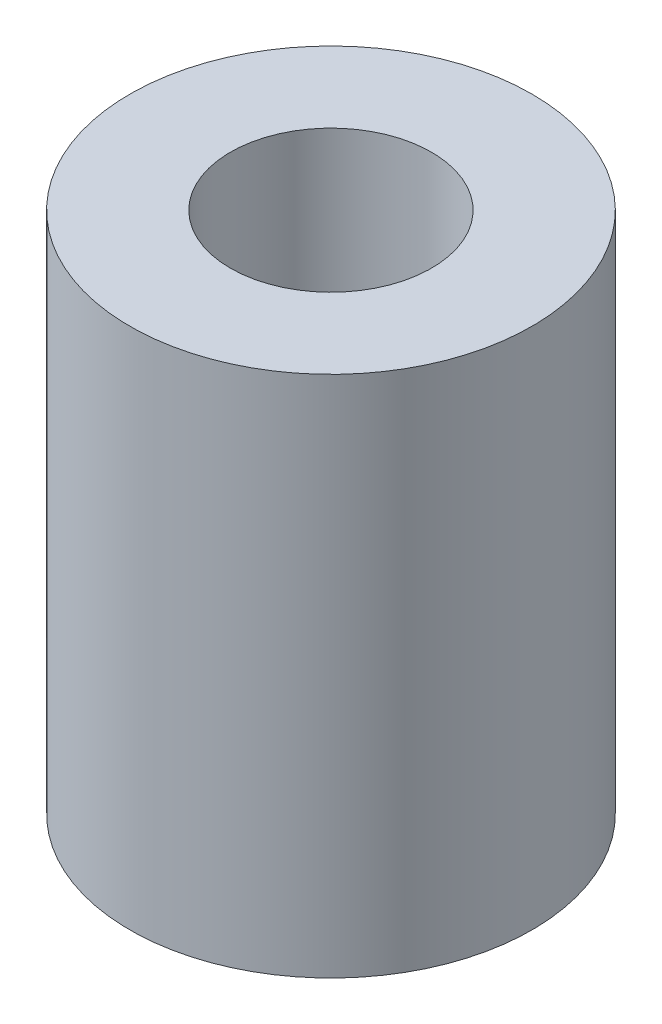
ISO-10303-21;
HEADER;
FILE_DESCRIPTION(('STEP AP214'),'2;1');
FILE_NAME('part.step','',(''),(''),'','','');
FILE_SCHEMA(('AUTOMOTIVE_DESIGN { 1 0 10303 214 1 1 1 1 }'));
ENDSEC;
DATA;
#1=APPLICATION_CONTEXT('core data for automotive mechanical design processes');
#2=APPLICATION_PROTOCOL_DEFINITION('international standard','automotive_design',2000,#1);
#3=PRODUCT_CONTEXT('',#1,'mechanical');
#4=PRODUCT('Part','Part','',(#3));
#5=PRODUCT_RELATED_PRODUCT_CATEGORY('part','',(#4));
#6=PRODUCT_DEFINITION_FORMATION('','',#4);
#7=PRODUCT_DEFINITION_CONTEXT('part definition',#1,'design');
#8=PRODUCT_DEFINITION('design','',#6,#7);
#9=PRODUCT_DEFINITION_SHAPE('','',#8);
#10=(LENGTH_UNIT() NAMED_UNIT(*) SI_UNIT(.MILLI.,.METRE.));
#11=(NAMED_UNIT(*) PLANE_ANGLE_UNIT() SI_UNIT($,.RADIAN.));
#12=(NAMED_UNIT(*) SI_UNIT($,.STERADIAN.) SOLID_ANGLE_UNIT());
#13=UNCERTAINTY_MEASURE_WITH_UNIT(LENGTH_MEASURE(1.E-05),#10,'distance_accuracy_value','');
#14=(GEOMETRIC_REPRESENTATION_CONTEXT(3) GLOBAL_UNCERTAINTY_ASSIGNED_CONTEXT((#13)) GLOBAL_UNIT_ASSIGNED_CONTEXT((#10,
#11,#12)) REPRESENTATION_CONTEXT('',''));
#15=CARTESIAN_POINT('',(0.,0.,0.));
#16=DIRECTION('',(0.,0.,1.));
#17=DIRECTION('',(1.,0.,0.));
#18=AXIS2_PLACEMENT_3D('',#15,#16,#17);
#19=CARTESIAN_POINT('',(-82.2959320967155,28.7074983767564,197.378926801223));
#20=DIRECTION('',(0.,1.,0.));
#21=DIRECTION('',(0.,0.,1.));
#22=AXIS2_PLACEMENT_3D('',#19,#20,#21);
#23=CYLINDRICAL_SURFACE('',#22,1.5875);
#24=CARTESIAN_POINT('',(-82.2959320967155,36.9624983767565,197.378926801223));
#25=DIRECTION('',(0.,1.,0.));
#26=DIRECTION('',(0.,0.,1.));
#27=AXIS2_PLACEMENT_3D('',#24,#25,#26);
#28=CIRCLE('',#27,1.5875);
#29=CARTESIAN_POINT('',(-82.2959320967155,36.9624983767565,198.966426801223));
#30=VERTEX_POINT('',#29);
#31=EDGE_CURVE('E18',#30,#30,#28,.F.);
#32=ORIENTED_EDGE('',*,*,#31,.F.);
#33=EDGE_LOOP('',(#32));
#34=FACE_BOUND('',#33,.T.);
#35=CARTESIAN_POINT('',(-82.2959320967155,28.7074983767564,197.378926801223));
#36=DIRECTION('',(0.,1.,0.));
#37=DIRECTION('',(0.,0.,1.));
#38=AXIS2_PLACEMENT_3D('',#35,#36,#37);
#39=CIRCLE('',#38,1.5875);
#40=CARTESIAN_POINT('',(-82.2959320967155,28.7074983767564,198.966426801223));
#41=VERTEX_POINT('',#40);
#42=EDGE_CURVE('E31',#41,#41,#39,.F.);
#43=ORIENTED_EDGE('',*,*,#42,.T.);
#44=EDGE_LOOP('',(#43));
#45=FACE_BOUND('',#44,.T.);
#46=ADVANCED_FACE('F15',(#34,#45),#23,.F.);
#47=CARTESIAN_POINT('',(-82.2959320967155,36.9624983767565,197.378926801223));
#48=DIRECTION('',(0.,1.,0.));
#49=DIRECTION('',(0.,0.,1.));
#50=AXIS2_PLACEMENT_3D('',#47,#48,#49);
#51=PLANE('',#50);
#52=ORIENTED_EDGE('',*,*,#31,.T.);
#53=EDGE_LOOP('',(#52));
#54=FACE_BOUND('',#53,.T.);
#55=CARTESIAN_POINT('',(-82.2959320967155,36.9624983767565,197.378926801223));
#56=DIRECTION('',(0.,-1.,0.));
#57=DIRECTION('',(0.,0.,-1.));
#58=AXIS2_PLACEMENT_3D('',#55,#56,#57);
#59=CIRCLE('',#58,3.175);
#60=CARTESIAN_POINT('',(-82.2959320967155,36.9624983767565,194.203926801223));
#61=VERTEX_POINT('',#60);
#62=EDGE_CURVE('E23',#61,#61,#59,.T.);
#63=ORIENTED_EDGE('',*,*,#62,.F.);
#64=EDGE_LOOP('',(#63));
#65=FACE_BOUND('',#64,.T.);
#66=ADVANCED_FACE('F40',(#54,#65),#51,.T.);
#67=CARTESIAN_POINT('',(-82.2959320967155,28.7074983767564,197.378926801223));
#68=DIRECTION('',(0.,1.,0.));
#69=DIRECTION('',(0.,0.,1.));
#70=AXIS2_PLACEMENT_3D('',#67,#68,#69);
#71=PLANE('',#70);
#72=ORIENTED_EDGE('',*,*,#42,.F.);
#73=EDGE_LOOP('',(#72));
#74=FACE_BOUND('',#73,.T.);
#75=CARTESIAN_POINT('',(-82.2959320967155,28.7074983767564,197.378926801223));
#76=DIRECTION('',(0.,-1.,0.));
#77=DIRECTION('',(0.,0.,-1.));
#78=AXIS2_PLACEMENT_3D('',#75,#76,#77);
#79=CIRCLE('',#78,3.175);
#80=CARTESIAN_POINT('',(-82.2959320967155,28.7074983767564,194.203926801223));
#81=VERTEX_POINT('',#80);
#82=EDGE_CURVE('E10',#81,#81,#79,.F.);
#83=ORIENTED_EDGE('',*,*,#82,.F.);
#84=EDGE_LOOP('',(#83));
#85=FACE_BOUND('',#84,.T.);
#86=ADVANCED_FACE('F47',(#74,#85),#71,.F.);
#87=CARTESIAN_POINT('',(-82.2959320967155,36.9624983767565,197.378926801223));
#88=DIRECTION('',(0.,-1.,0.));
#89=DIRECTION('',(0.,0.,-1.));
#90=AXIS2_PLACEMENT_3D('',#87,#88,#89);
#91=CYLINDRICAL_SURFACE('',#90,3.175);
#92=ORIENTED_EDGE('',*,*,#82,.T.);
#93=EDGE_LOOP('',(#92));
#94=FACE_BOUND('',#93,.T.);
#95=ORIENTED_EDGE('',*,*,#62,.T.);
#96=EDGE_LOOP('',(#95));
#97=FACE_BOUND('',#96,.T.);
#98=ADVANCED_FACE('F48',(#94,#97),#91,.T.);
#99=CLOSED_SHELL('',(#46,#66,#86,#98));
#100=MANIFOLD_SOLID_BREP('B1',#99);
#101=ADVANCED_BREP_SHAPE_REPRESENTATION('',(#18,#100),#14);
#102=SHAPE_DEFINITION_REPRESENTATION(#9,#101);
ENDSEC;
END-ISO-10303-21;
